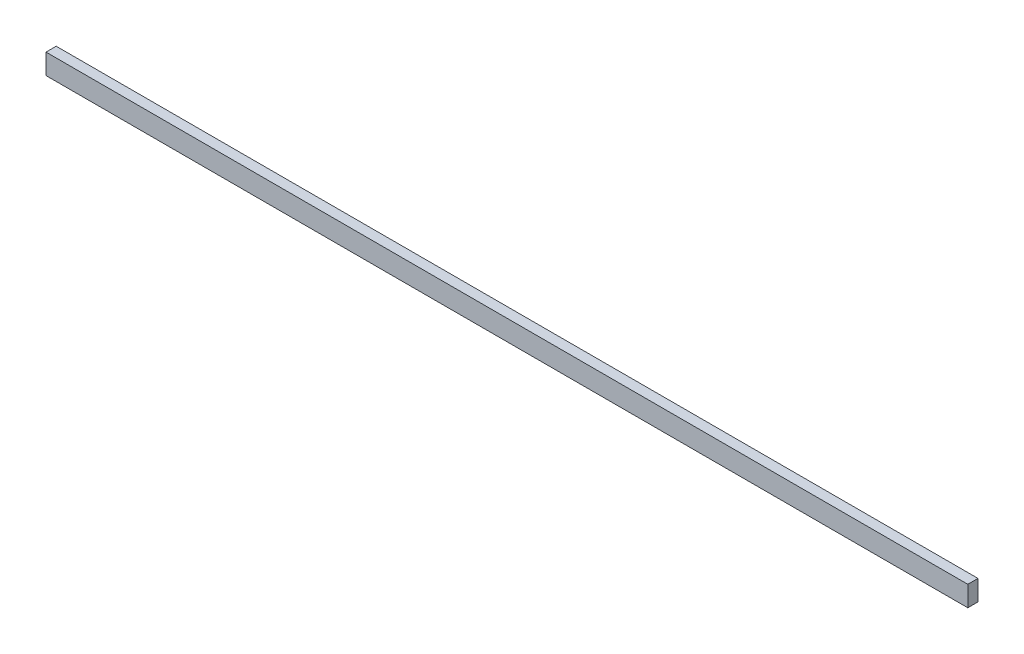
ISO-10303-21;
HEADER;
FILE_DESCRIPTION(('STEP AP214'),'2;1');
FILE_NAME('part.step','',(''),(''),'','','');
FILE_SCHEMA(('AUTOMOTIVE_DESIGN { 1 0 10303 214 1 1 1 1 }'));
ENDSEC;
DATA;
#1=APPLICATION_CONTEXT('core data for automotive mechanical design processes');
#2=APPLICATION_PROTOCOL_DEFINITION('international standard','automotive_design',2000,#1);
#3=PRODUCT_CONTEXT('',#1,'mechanical');
#4=PRODUCT('Part','Part','',(#3));
#5=PRODUCT_RELATED_PRODUCT_CATEGORY('part','',(#4));
#6=PRODUCT_DEFINITION_FORMATION('','',#4);
#7=PRODUCT_DEFINITION_CONTEXT('part definition',#1,'design');
#8=PRODUCT_DEFINITION('design','',#6,#7);
#9=PRODUCT_DEFINITION_SHAPE('','',#8);
#10=(LENGTH_UNIT() NAMED_UNIT(*) SI_UNIT(.MILLI.,.METRE.));
#11=(NAMED_UNIT(*) PLANE_ANGLE_UNIT() SI_UNIT($,.RADIAN.));
#12=(NAMED_UNIT(*) SI_UNIT($,.STERADIAN.) SOLID_ANGLE_UNIT());
#13=UNCERTAINTY_MEASURE_WITH_UNIT(LENGTH_MEASURE(1.E-05),#10,'distance_accuracy_value','');
#14=(GEOMETRIC_REPRESENTATION_CONTEXT(3) GLOBAL_UNCERTAINTY_ASSIGNED_CONTEXT((#13)) GLOBAL_UNIT_ASSIGNED_CONTEXT((#10,
#11,#12)) REPRESENTATION_CONTEXT('',''));
#15=CARTESIAN_POINT('',(0.,0.,0.));
#16=DIRECTION('',(0.,0.,1.));
#17=DIRECTION('',(1.,0.,0.));
#18=AXIS2_PLACEMENT_3D('',#15,#16,#17);
#19=CARTESIAN_POINT('',(-5.,215.5,2.));
#20=DIRECTION('',(1.,0.,0.));
#21=DIRECTION('',(0.,0.,-1.));
#22=AXIS2_PLACEMENT_3D('',#19,#20,#21);
#23=PLANE('',#22);
#24=DIRECTION('',(0.,-1.,0.));
#25=VECTOR('',#24,1.);
#26=CARTESIAN_POINT('',(-5.,215.5,0.));
#27=LINE('',#26,#25);
#28=CARTESIAN_POINT('',(-5.,219.5,0.));
#29=VERTEX_POINT('',#28);
#30=CARTESIAN_POINT('',(-5.,215.5,0.));
#31=VERTEX_POINT('',#30);
#32=EDGE_CURVE('E98',#29,#31,#27,.T.);
#33=ORIENTED_EDGE('',*,*,#32,.T.);
#34=DIRECTION('',(0.,0.,-1.));
#35=VECTOR('',#34,1.);
#36=CARTESIAN_POINT('',(-5.,215.5,2.));
#37=LINE('',#36,#35);
#38=CARTESIAN_POINT('',(-5.,215.5,2.));
#39=VERTEX_POINT('',#38);
#40=EDGE_CURVE('E11',#39,#31,#37,.T.);
#41=ORIENTED_EDGE('',*,*,#40,.F.);
#42=DIRECTION('',(0.,-1.,0.));
#43=VECTOR('',#42,1.);
#44=CARTESIAN_POINT('',(-5.,215.5,2.));
#45=LINE('',#44,#43);
#46=CARTESIAN_POINT('',(-5.,219.5,2.));
#47=VERTEX_POINT('',#46);
#48=EDGE_CURVE('E86',#47,#39,#45,.T.);
#49=ORIENTED_EDGE('',*,*,#48,.F.);
#50=DIRECTION('',(0.,0.,-1.));
#51=VECTOR('',#50,1.);
#52=CARTESIAN_POINT('',(-5.,219.5,2.));
#53=LINE('',#52,#51);
#54=EDGE_CURVE('E94',#47,#29,#53,.T.);
#55=ORIENTED_EDGE('',*,*,#54,.T.);
#56=EDGE_LOOP('',(#33,#41,#49,#55));
#57=FACE_BOUND('',#56,.T.);
#58=ADVANCED_FACE('F35',(#57),#23,.F.);
#59=CARTESIAN_POINT('',(-5.,215.5,2.));
#60=DIRECTION('',(0.,1.,0.));
#61=DIRECTION('',(0.,0.,1.));
#62=AXIS2_PLACEMENT_3D('',#59,#60,#61);
#63=PLANE('',#62);
#64=DIRECTION('',(1.,0.,0.));
#65=VECTOR('',#64,1.);
#66=CARTESIAN_POINT('',(-5.,215.5,0.));
#67=LINE('',#66,#65);
#68=CARTESIAN_POINT('',(176.,215.5,0.));
#69=VERTEX_POINT('',#68);
#70=EDGE_CURVE('E90',#31,#69,#67,.T.);
#71=ORIENTED_EDGE('',*,*,#70,.T.);
#72=DIRECTION('',(0.,0.,-1.));
#73=VECTOR('',#72,1.);
#74=CARTESIAN_POINT('',(176.,215.5,2.));
#75=LINE('',#74,#73);
#76=CARTESIAN_POINT('',(176.,215.5,2.));
#77=VERTEX_POINT('',#76);
#78=EDGE_CURVE('E43',#77,#69,#75,.T.);
#79=ORIENTED_EDGE('',*,*,#78,.F.);
#80=DIRECTION('',(1.,0.,0.));
#81=VECTOR('',#80,1.);
#82=CARTESIAN_POINT('',(-5.,215.5,2.));
#83=LINE('',#82,#81);
#84=EDGE_CURVE('E81',#39,#77,#83,.T.);
#85=ORIENTED_EDGE('',*,*,#84,.F.);
#86=ORIENTED_EDGE('',*,*,#40,.T.);
#87=EDGE_LOOP('',(#71,#79,#85,#86));
#88=FACE_BOUND('',#87,.T.);
#89=ADVANCED_FACE('F89',(#88),#63,.F.);
#90=CARTESIAN_POINT('',(176.,215.5,2.));
#91=DIRECTION('',(-1.,0.,0.));
#92=DIRECTION('',(0.,0.,1.));
#93=AXIS2_PLACEMENT_3D('',#90,#91,#92);
#94=PLANE('',#93);
#95=DIRECTION('',(0.,1.,0.));
#96=VECTOR('',#95,1.);
#97=CARTESIAN_POINT('',(176.,215.5,0.));
#98=LINE('',#97,#96);
#99=CARTESIAN_POINT('',(176.,219.5,0.));
#100=VERTEX_POINT('',#99);
#101=EDGE_CURVE('E68',#69,#100,#98,.T.);
#102=ORIENTED_EDGE('',*,*,#101,.T.);
#103=DIRECTION('',(0.,0.,-1.));
#104=VECTOR('',#103,1.);
#105=CARTESIAN_POINT('',(176.,219.5,2.));
#106=LINE('',#105,#104);
#107=CARTESIAN_POINT('',(176.,219.5,2.));
#108=VERTEX_POINT('',#107);
#109=EDGE_CURVE('E91',#108,#100,#106,.T.);
#110=ORIENTED_EDGE('',*,*,#109,.F.);
#111=DIRECTION('',(0.,1.,0.));
#112=VECTOR('',#111,1.);
#113=CARTESIAN_POINT('',(176.,215.5,2.));
#114=LINE('',#113,#112);
#115=EDGE_CURVE('E84',#77,#108,#114,.T.);
#116=ORIENTED_EDGE('',*,*,#115,.F.);
#117=ORIENTED_EDGE('',*,*,#78,.T.);
#118=EDGE_LOOP('',(#102,#110,#116,#117));
#119=FACE_BOUND('',#118,.T.);
#120=ADVANCED_FACE('F92',(#119),#94,.F.);
#121=CARTESIAN_POINT('',(-5.,219.5,2.));
#122=DIRECTION('',(0.,-1.,0.));
#123=DIRECTION('',(0.,0.,-1.));
#124=AXIS2_PLACEMENT_3D('',#121,#122,#123);
#125=PLANE('',#124);
#126=DIRECTION('',(-1.,0.,0.));
#127=VECTOR('',#126,1.);
#128=CARTESIAN_POINT('',(-5.,219.5,0.));
#129=LINE('',#128,#127);
#130=EDGE_CURVE('E74',#100,#29,#129,.T.);
#131=ORIENTED_EDGE('',*,*,#130,.T.);
#132=ORIENTED_EDGE('',*,*,#54,.F.);
#133=DIRECTION('',(-1.,0.,0.));
#134=VECTOR('',#133,1.);
#135=CARTESIAN_POINT('',(-5.,219.5,2.));
#136=LINE('',#135,#134);
#137=EDGE_CURVE('E51',#108,#47,#136,.T.);
#138=ORIENTED_EDGE('',*,*,#137,.F.);
#139=ORIENTED_EDGE('',*,*,#109,.T.);
#140=EDGE_LOOP('',(#131,#132,#138,#139));
#141=FACE_BOUND('',#140,.T.);
#142=ADVANCED_FACE('F105',(#141),#125,.F.);
#143=CARTESIAN_POINT('',(0.,0.,2.));
#144=DIRECTION('',(0.,0.,-1.));
#145=DIRECTION('',(-1.,0.,0.));
#146=AXIS2_PLACEMENT_3D('',#143,#144,#145);
#147=PLANE('',#146);
#148=ORIENTED_EDGE('',*,*,#48,.T.);
#149=ORIENTED_EDGE('',*,*,#84,.T.);
#150=ORIENTED_EDGE('',*,*,#115,.T.);
#151=ORIENTED_EDGE('',*,*,#137,.T.);
#152=EDGE_LOOP('',(#148,#149,#150,#151));
#153=FACE_BOUND('',#152,.T.);
#154=ADVANCED_FACE('F82',(#153),#147,.F.);
#155=CARTESIAN_POINT('',(0.,0.,0.));
#156=DIRECTION('',(0.,0.,-1.));
#157=DIRECTION('',(-1.,0.,0.));
#158=AXIS2_PLACEMENT_3D('',#155,#156,#157);
#159=PLANE('',#158);
#160=ORIENTED_EDGE('',*,*,#32,.F.);
#161=ORIENTED_EDGE('',*,*,#130,.F.);
#162=ORIENTED_EDGE('',*,*,#101,.F.);
#163=ORIENTED_EDGE('',*,*,#70,.F.);
#164=EDGE_LOOP('',(#160,#161,#162,#163));
#165=FACE_BOUND('',#164,.T.);
#166=ADVANCED_FACE('F108',(#165),#159,.T.);
#167=CLOSED_SHELL('',(#58,#89,#120,#142,#154,#166));
#168=MANIFOLD_SOLID_BREP('B2',#167);
#169=ADVANCED_BREP_SHAPE_REPRESENTATION('',(#18,#168),#14);
#170=SHAPE_DEFINITION_REPRESENTATION(#9,#169);
ENDSEC;
END-ISO-10303-21;
